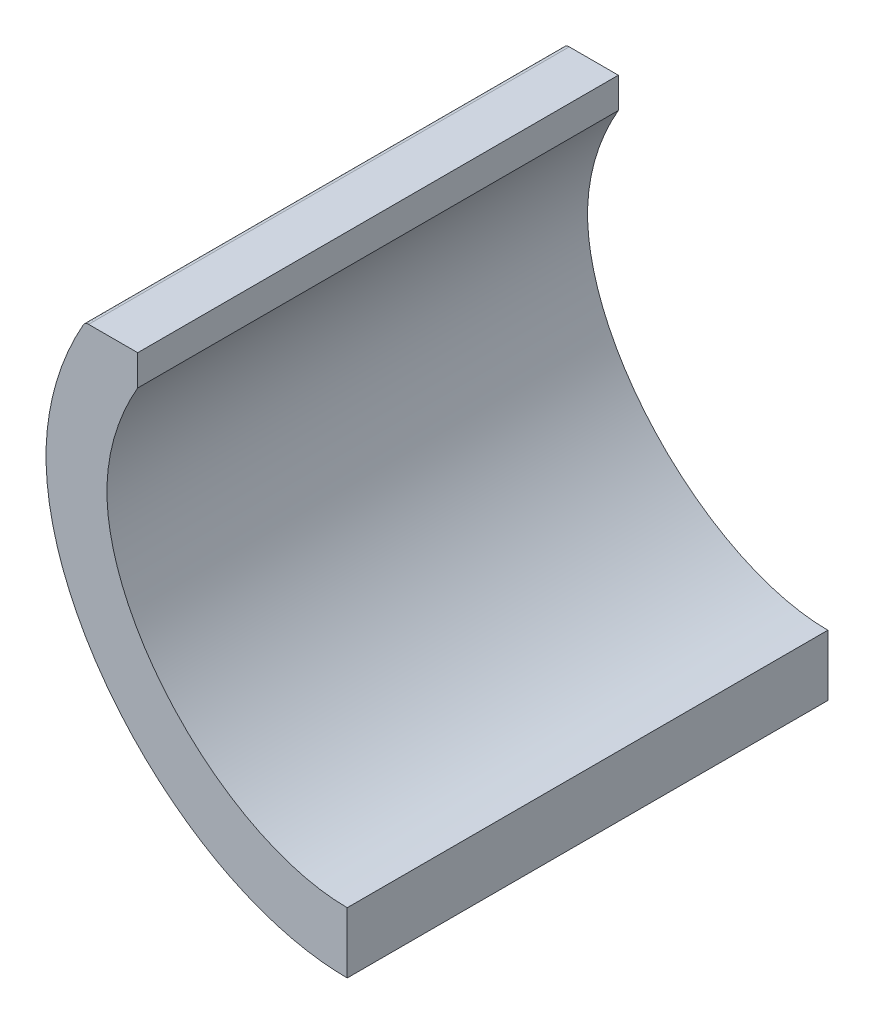
ISO-10303-21;
HEADER;
FILE_DESCRIPTION(('STEP AP214'),'2;1');
FILE_NAME('part.step','',(''),(''),'','','');
FILE_SCHEMA(('AUTOMOTIVE_DESIGN { 1 0 10303 214 1 1 1 1 }'));
ENDSEC;
DATA;
#1=APPLICATION_CONTEXT('core data for automotive mechanical design processes');
#2=APPLICATION_PROTOCOL_DEFINITION('international standard','automotive_design',2000,#1);
#3=PRODUCT_CONTEXT('',#1,'mechanical');
#4=PRODUCT('Part','Part','',(#3));
#5=PRODUCT_RELATED_PRODUCT_CATEGORY('part','',(#4));
#6=PRODUCT_DEFINITION_FORMATION('','',#4);
#7=PRODUCT_DEFINITION_CONTEXT('part definition',#1,'design');
#8=PRODUCT_DEFINITION('design','',#6,#7);
#9=PRODUCT_DEFINITION_SHAPE('','',#8);
#10=(LENGTH_UNIT() NAMED_UNIT(*) SI_UNIT(.MILLI.,.METRE.));
#11=(NAMED_UNIT(*) PLANE_ANGLE_UNIT() SI_UNIT($,.RADIAN.));
#12=(NAMED_UNIT(*) SI_UNIT($,.STERADIAN.) SOLID_ANGLE_UNIT());
#13=UNCERTAINTY_MEASURE_WITH_UNIT(LENGTH_MEASURE(1.E-05),#10,'distance_accuracy_value','');
#14=(GEOMETRIC_REPRESENTATION_CONTEXT(3) GLOBAL_UNCERTAINTY_ASSIGNED_CONTEXT((#13)) GLOBAL_UNIT_ASSIGNED_CONTEXT((#10,
#11,#12)) REPRESENTATION_CONTEXT('',''));
#15=CARTESIAN_POINT('',(0.,0.,0.));
#16=DIRECTION('',(0.,0.,1.));
#17=DIRECTION('',(1.,0.,0.));
#18=AXIS2_PLACEMENT_3D('',#15,#16,#17);
#19=CARTESIAN_POINT('',(-103.230490721796,66.7999999999998,859.861918527202));
#20=DIRECTION('',(6.86583194358813E-12,-1.,0.));
#21=DIRECTION('',(1.,6.86583194358813E-12,0.));
#22=AXIS2_PLACEMENT_3D('',#19,#20,#21);
#23=PLANE('',#22);
#24=DIRECTION('',(-1.,-6.86583194358813E-12,0.));
#25=VECTOR('',#24,1.);
#26=CARTESIAN_POINT('',(-103.230490721796,66.7999999999998,331.59));
#27=LINE('',#26,#25);
#28=CARTESIAN_POINT('',(-103.230490721796,66.7999999999998,331.59));
#29=VERTEX_POINT('',#28);
#30=CARTESIAN_POINT('',(-127.439296538631,66.7999999998336,331.59));
#31=VERTEX_POINT('',#30);
#32=EDGE_CURVE('E125',#29,#31,#27,.T.);
#33=ORIENTED_EDGE('',*,*,#32,.T.);
#34=DIRECTION('',(0.,0.,-1.));
#35=VECTOR('',#34,1.);
#36=CARTESIAN_POINT('',(-127.439296538631,66.7999999998336,859.861918527202));
#37=LINE('',#36,#35);
#38=CARTESIAN_POINT('',(-127.439296538631,66.7999999998336,568.400025));
#39=VERTEX_POINT('',#38);
#40=EDGE_CURVE('E51',#31,#39,#37,.F.);
#41=ORIENTED_EDGE('',*,*,#40,.T.);
#42=DIRECTION('',(1.,6.86583194358813E-12,0.));
#43=VECTOR('',#42,1.);
#44=CARTESIAN_POINT('',(-103.230490721796,66.7999999999998,568.400025));
#45=LINE('',#44,#43);
#46=CARTESIAN_POINT('',(-103.230490721796,66.7999999999998,568.400025));
#47=VERTEX_POINT('',#46);
#48=EDGE_CURVE('E139',#39,#47,#45,.T.);
#49=ORIENTED_EDGE('',*,*,#48,.T.);
#50=DIRECTION('',(0.,0.,-1.));
#51=VECTOR('',#50,1.);
#52=CARTESIAN_POINT('',(-103.230490721796,66.7999999999998,859.861918527202));
#53=LINE('',#52,#51);
#54=EDGE_CURVE('E124',#47,#29,#53,.T.);
#55=ORIENTED_EDGE('',*,*,#54,.T.);
#56=EDGE_LOOP('',(#33,#41,#49,#55));
#57=FACE_BOUND('',#56,.T.);
#58=ADVANCED_FACE('F43',(#57),#23,.F.);
#59=CARTESIAN_POINT('',(-103.230490721796,51.7420302405128,859.861918527202));
#60=DIRECTION('',(-1.,0.,0.));
#61=DIRECTION('',(0.,0.,1.));
#62=AXIS2_PLACEMENT_3D('',#59,#60,#61);
#63=PLANE('',#62);
#64=ORIENTED_EDGE('',*,*,#54,.F.);
#65=DIRECTION('',(0.,-1.,0.));
#66=VECTOR('',#65,1.);
#67=CARTESIAN_POINT('',(-103.230490721796,51.7420302405128,568.400025));
#68=LINE('',#67,#66);
#69=CARTESIAN_POINT('',(-103.230490721796,51.7420302405128,568.400025));
#70=VERTEX_POINT('',#69);
#71=EDGE_CURVE('E133',#47,#70,#68,.T.);
#72=ORIENTED_EDGE('',*,*,#71,.T.);
#73=DIRECTION('',(0.,0.,-1.));
#74=VECTOR('',#73,1.);
#75=CARTESIAN_POINT('',(-103.230490721796,51.7420302405128,859.861918527202));
#76=LINE('',#75,#74);
#77=CARTESIAN_POINT('',(-103.230490721796,51.7420302405128,331.59));
#78=VERTEX_POINT('',#77);
#79=EDGE_CURVE('E106',#70,#78,#76,.T.);
#80=ORIENTED_EDGE('',*,*,#79,.T.);
#81=DIRECTION('',(0.,1.,0.));
#82=VECTOR('',#81,1.);
#83=CARTESIAN_POINT('',(-103.230490721796,51.7420302405128,331.59));
#84=LINE('',#83,#82);
#85=EDGE_CURVE('E113',#78,#29,#84,.T.);
#86=ORIENTED_EDGE('',*,*,#85,.T.);
#87=EDGE_LOOP('',(#64,#72,#80,#86));
#88=FACE_BOUND('',#87,.T.);
#89=ADVANCED_FACE('F177',(#88),#63,.F.);
#90=CARTESIAN_POINT('',(6.41693228043019E-13,-118.400358856441,859.861918527202));
#91=CARTESIAN_POINT('',(-2.30369339179519,-118.400358856441,859.861918527202));
#92=CARTESIAN_POINT('',(-6.89855138055569,-118.205079600366,859.861918527202));
#93=CARTESIAN_POINT('',(-16.1400862810674,-117.063562247159,859.861918527202));
#94=CARTESIAN_POINT('',(-27.7706209094074,-114.278096666344,859.861918527202));
#95=CARTESIAN_POINT('',(-41.7775082353818,-108.787982078801,859.861918527202));
#96=CARTESIAN_POINT('',(-52.8588280845476,-102.77303190265,859.861918527202));
#97=CARTESIAN_POINT('',(-61.3932027242065,-97.1516682907299,859.861918527202));
#98=CARTESIAN_POINT('',(-67.6550724664353,-92.5084789469402,859.861918527202));
#99=CARTESIAN_POINT('',(-73.6989429448788,-87.5008925709732,859.861918527202));
#100=CARTESIAN_POINT('',(-79.4310143248655,-82.2116743731237,859.861918527202));
#101=CARTESIAN_POINT('',(-84.8458794592777,-76.652178793742,859.861918527202));
#102=CARTESIAN_POINT('',(-91.6796199009428,-68.8528896032404,859.861918527202));
#103=CARTESIAN_POINT('',(-97.8613810126001,-60.5401648939101,859.861918527202));
#104=CARTESIAN_POINT('',(-103.300564171315,-51.7703348033556,859.861918527202));
#105=CARTESIAN_POINT('',(-106.913108193542,-45.1017593500004,859.861918527202));
#106=CARTESIAN_POINT('',(-110.090532471186,-38.3001946011175,859.861918527202));
#107=CARTESIAN_POINT('',(-113.679857664725,-29.1493740388695,859.861918527202));
#108=CARTESIAN_POINT('',(-116.331962276113,-19.6740947555543,859.861918527202));
#109=CARTESIAN_POINT('',(-117.843057129504,-10.3834760324185,859.861918527202));
#110=CARTESIAN_POINT('',(-118.417692187507,-3.49664421062236,859.861918527202));
#111=CARTESIAN_POINT('',(-118.429616298773,3.30372576368881,859.861918527202));
#112=CARTESIAN_POINT('',(-117.85285371865,10.3223621182549,859.861918527202));
#113=CARTESIAN_POINT('',(-116.719335417404,17.2909026837772,859.861918527202));
#114=CARTESIAN_POINT('',(-115.041411044254,24.294482858941,859.861918527202));
#115=CARTESIAN_POINT('',(-112.843468002431,31.2634365724681,859.861918527202));
#116=CARTESIAN_POINT('',(-109.206181561247,40.5661828674215,859.861918527202));
#117=CARTESIAN_POINT('',(-105.762926527156,47.3782523280321,859.861918527202));
#118=CARTESIAN_POINT('',(-103.230490721796,51.7420302405128,859.861918527202));
#119=B_SPLINE_CURVE_WITH_KNOTS('',3,(#90,#91,#92,#93,#94,#95,#96,#97,#98,#99,#100,#101,#102,
#103,#104,#105,#106,#107,#108,#109,#110,#111,#112,#113,#114,#115,#116,#117,#118),.UNSPECIFIED.,
.F.,.F.,(4,1,1,1,1,1,1,1,1,1,1,1,1,1,1,1,1,1,1,1,1,1,1,1,1,1,4),(0.118137711005709,
0.14569590753678,0.173254104067852,0.228370497129995,0.283486890192138,0.338603283254282,
0.366161479785353,0.393719676316425,0.421277872847496,0.448836069378568,0.47639426590964,
0.503952462440711,0.559068855502854,0.586627052033926,0.614185248564998,0.641743445096069,
0.669301641627141,0.724418034689284,0.751976231220356,0.779534427751427,0.807092624282499,
0.83465082081357,0.862209017344642,0.889767213875714,0.917325410406785,0.944883606937857,1.),.UNSPECIFIED.);
#120=DIRECTION('',(0.,0.,-1.));
#121=VECTOR('',#120,1.);
#122=SURFACE_OF_LINEAR_EXTRUSION('',#119,#121);
#123=ORIENTED_EDGE('',*,*,#79,.F.);
#124=CARTESIAN_POINT('',(6.41693228043019E-13,-118.400358856441,568.400025));
#125=CARTESIAN_POINT('',(-2.30369339179519,-118.400358856441,568.400025));
#126=CARTESIAN_POINT('',(-6.89855138055569,-118.205079600366,568.400025));
#127=CARTESIAN_POINT('',(-16.1400862810674,-117.063562247159,568.400025));
#128=CARTESIAN_POINT('',(-27.7706209094074,-114.278096666344,568.400025));
#129=CARTESIAN_POINT('',(-41.7775082353818,-108.787982078801,568.400025));
#130=CARTESIAN_POINT('',(-52.8588280845476,-102.77303190265,568.400025));
#131=CARTESIAN_POINT('',(-61.3932027242065,-97.1516682907299,568.400025));
#132=CARTESIAN_POINT('',(-67.6550724664353,-92.5084789469402,568.400025));
#133=CARTESIAN_POINT('',(-73.6989429448788,-87.5008925709732,568.400025));
#134=CARTESIAN_POINT('',(-79.4310143248655,-82.2116743731237,568.400025));
#135=CARTESIAN_POINT('',(-84.8458794592777,-76.652178793742,568.400025));
#136=CARTESIAN_POINT('',(-91.6796199009428,-68.8528896032404,568.400025));
#137=CARTESIAN_POINT('',(-97.8613810126001,-60.5401648939101,568.400025));
#138=CARTESIAN_POINT('',(-103.300564171315,-51.7703348033556,568.400025));
#139=CARTESIAN_POINT('',(-106.913108193542,-45.1017593500004,568.400025));
#140=CARTESIAN_POINT('',(-110.090532471186,-38.3001946011175,568.400025));
#141=CARTESIAN_POINT('',(-113.679857664725,-29.1493740388695,568.400025));
#142=CARTESIAN_POINT('',(-116.331962276113,-19.6740947555543,568.400025));
#143=CARTESIAN_POINT('',(-117.843057129504,-10.3834760324185,568.400025));
#144=CARTESIAN_POINT('',(-118.417692187507,-3.49664421062236,568.400025));
#145=CARTESIAN_POINT('',(-118.429616298773,3.30372576368881,568.400025));
#146=CARTESIAN_POINT('',(-117.85285371865,10.3223621182549,568.400025));
#147=CARTESIAN_POINT('',(-116.719335417404,17.2909026837772,568.400025));
#148=CARTESIAN_POINT('',(-115.041411044254,24.294482858941,568.400025));
#149=CARTESIAN_POINT('',(-112.843468002431,31.2634365724681,568.400025));
#150=CARTESIAN_POINT('',(-109.206181561247,40.5661828674215,568.400025));
#151=CARTESIAN_POINT('',(-105.762926527156,47.3782523280321,568.400025));
#152=CARTESIAN_POINT('',(-103.230490721796,51.7420302405128,568.400025));
#153=B_SPLINE_CURVE_WITH_KNOTS('',3,(#124,#125,#126,#127,#128,#129,#130,#131,#132,#133,#134,
#135,#136,#137,#138,#139,#140,#141,#142,#143,#144,#145,#146,#147,#148,#149,#150,#151,#152),
.UNSPECIFIED.,.F.,.F.,(4,1,1,1,1,1,1,1,1,1,1,1,1,1,1,1,1,1,1,1,1,1,1,1,1,1,4),
(0.118137711005709,0.14569590753678,0.173254104067852,0.228370497129995,0.283486890192138,
0.338603283254282,0.366161479785353,0.393719676316425,0.421277872847496,0.448836069378568,
0.47639426590964,0.503952462440711,0.559068855502854,0.586627052033926,0.614185248564998,
0.641743445096069,0.669301641627141,0.724418034689284,0.751976231220356,0.779534427751427,
0.807092624282499,0.83465082081357,0.862209017344642,0.889767213875714,0.917325410406785,
0.944883606937857,1.),.UNSPECIFIED.);
#154=CARTESIAN_POINT('',(6.41693228043019E-13,-118.400358856441,568.400025));
#155=VERTEX_POINT('',#154);
#156=EDGE_CURVE('E101',#70,#155,#153,.F.);
#157=ORIENTED_EDGE('',*,*,#156,.T.);
#158=DIRECTION('',(0.,0.,-1.));
#159=VECTOR('',#158,1.);
#160=CARTESIAN_POINT('',(6.41693228043019E-13,-118.400358856441,859.861918527202));
#161=LINE('',#160,#159);
#162=CARTESIAN_POINT('',(6.41693228043019E-13,-118.400358856441,331.59));
#163=VERTEX_POINT('',#162);
#164=EDGE_CURVE('E96',#155,#163,#161,.T.);
#165=ORIENTED_EDGE('',*,*,#164,.T.);
#166=CARTESIAN_POINT('',(6.41693228043019E-13,-118.400358856441,331.59));
#167=CARTESIAN_POINT('',(-2.30369339179519,-118.400358856441,331.59));
#168=CARTESIAN_POINT('',(-6.89855138055569,-118.205079600366,331.59));
#169=CARTESIAN_POINT('',(-16.1400862810674,-117.063562247159,331.59));
#170=CARTESIAN_POINT('',(-27.7706209094074,-114.278096666344,331.59));
#171=CARTESIAN_POINT('',(-41.7775082353818,-108.787982078801,331.59));
#172=CARTESIAN_POINT('',(-52.8588280845476,-102.77303190265,331.59));
#173=CARTESIAN_POINT('',(-61.3932027242065,-97.1516682907299,331.59));
#174=CARTESIAN_POINT('',(-67.6550724664353,-92.5084789469402,331.59));
#175=CARTESIAN_POINT('',(-73.6989429448788,-87.5008925709732,331.59));
#176=CARTESIAN_POINT('',(-79.4310143248655,-82.2116743731237,331.59));
#177=CARTESIAN_POINT('',(-84.8458794592777,-76.652178793742,331.59));
#178=CARTESIAN_POINT('',(-91.6796199009428,-68.8528896032404,331.59));
#179=CARTESIAN_POINT('',(-97.8613810126001,-60.5401648939101,331.59));
#180=CARTESIAN_POINT('',(-103.300564171315,-51.7703348033556,331.59));
#181=CARTESIAN_POINT('',(-106.913108193542,-45.1017593500004,331.59));
#182=CARTESIAN_POINT('',(-110.090532471186,-38.3001946011175,331.59));
#183=CARTESIAN_POINT('',(-113.679857664725,-29.1493740388695,331.59));
#184=CARTESIAN_POINT('',(-116.331962276113,-19.6740947555543,331.59));
#185=CARTESIAN_POINT('',(-117.843057129504,-10.3834760324185,331.59));
#186=CARTESIAN_POINT('',(-118.417692187507,-3.49664421062236,331.59));
#187=CARTESIAN_POINT('',(-118.429616298773,3.30372576368881,331.59));
#188=CARTESIAN_POINT('',(-117.85285371865,10.3223621182549,331.59));
#189=CARTESIAN_POINT('',(-116.719335417404,17.2909026837772,331.59));
#190=CARTESIAN_POINT('',(-115.041411044254,24.294482858941,331.59));
#191=CARTESIAN_POINT('',(-112.843468002431,31.2634365724681,331.59));
#192=CARTESIAN_POINT('',(-109.206181561247,40.5661828674215,331.59));
#193=CARTESIAN_POINT('',(-105.762926527156,47.3782523280321,331.59));
#194=CARTESIAN_POINT('',(-103.230490721796,51.7420302405128,331.59));
#195=B_SPLINE_CURVE_WITH_KNOTS('',3,(#166,#167,#168,#169,#170,#171,#172,#173,#174,#175,#176,
#177,#178,#179,#180,#181,#182,#183,#184,#185,#186,#187,#188,#189,#190,#191,#192,#193,#194),
.UNSPECIFIED.,.F.,.F.,(4,1,1,1,1,1,1,1,1,1,1,1,1,1,1,1,1,1,1,1,1,1,1,1,1,1,4),
(0.118137711005709,0.14569590753678,0.173254104067852,0.228370497129995,0.283486890192138,
0.338603283254282,0.366161479785353,0.393719676316425,0.421277872847496,0.448836069378568,
0.47639426590964,0.503952462440711,0.559068855502854,0.586627052033926,0.614185248564998,
0.641743445096069,0.669301641627141,0.724418034689284,0.751976231220356,0.779534427751427,
0.807092624282499,0.83465082081357,0.862209017344642,0.889767213875714,0.917325410406785,
0.944883606937857,1.),.UNSPECIFIED.);
#196=EDGE_CURVE('E100',#163,#78,#195,.T.);
#197=ORIENTED_EDGE('',*,*,#196,.T.);
#198=EDGE_LOOP('',(#123,#157,#165,#197));
#199=FACE_BOUND('',#198,.T.);
#200=ADVANCED_FACE('F99',(#199),#122,.F.);
#201=CARTESIAN_POINT('',(0.,-148.400358856441,859.861918527202));
#202=DIRECTION('',(-1.,0.,0.));
#203=DIRECTION('',(0.,-1.,0.));
#204=AXIS2_PLACEMENT_3D('',#201,#202,#203);
#205=PLANE('',#204);
#206=ORIENTED_EDGE('',*,*,#164,.F.);
#207=DIRECTION('',(0.,-1.,0.));
#208=VECTOR('',#207,1.);
#209=CARTESIAN_POINT('',(0.,-148.400358856441,568.400025));
#210=LINE('',#209,#208);
#211=CARTESIAN_POINT('',(0.,-148.400358856441,568.400025));
#212=VERTEX_POINT('',#211);
#213=EDGE_CURVE('E143',#155,#212,#210,.T.);
#214=ORIENTED_EDGE('',*,*,#213,.T.);
#215=DIRECTION('',(0.,0.,-1.));
#216=VECTOR('',#215,1.);
#217=CARTESIAN_POINT('',(0.,-148.400358856441,859.861918527202));
#218=LINE('',#217,#216);
#219=CARTESIAN_POINT('',(0.,-148.400358856441,331.59));
#220=VERTEX_POINT('',#219);
#221=EDGE_CURVE('E105',#212,#220,#218,.T.);
#222=ORIENTED_EDGE('',*,*,#221,.T.);
#223=DIRECTION('',(0.,1.,0.));
#224=VECTOR('',#223,1.);
#225=CARTESIAN_POINT('',(0.,-148.400358856441,331.59));
#226=LINE('',#225,#224);
#227=EDGE_CURVE('E111',#220,#163,#226,.T.);
#228=ORIENTED_EDGE('',*,*,#227,.T.);
#229=EDGE_LOOP('',(#206,#214,#222,#228));
#230=FACE_BOUND('',#229,.T.);
#231=ADVANCED_FACE('F116',(#230),#205,.F.);
#232=CARTESIAN_POINT('',(-129.177697637527,66.7999999998217,859.861918527202));
#233=CARTESIAN_POINT('',(-129.620986666455,66.0361445570939,859.861918527202));
#234=CARTESIAN_POINT('',(-131.753376367597,62.2914469652341,859.861918527202));
#235=CARTESIAN_POINT('',(-135.362753212301,55.3148651511315,859.861918527202));
#236=CARTESIAN_POINT('',(-139.587846980681,45.5546852918928,859.861918527202));
#237=CARTESIAN_POINT('',(-143.085982257748,35.4803719773955,859.861918527202));
#238=CARTESIAN_POINT('',(-145.768738442522,25.2172081265002,859.861918527202));
#239=CARTESIAN_POINT('',(-147.598187784864,14.7561872219411,859.861918527202));
#240=CARTESIAN_POINT('',(-148.496219867338,4.04425788042876,859.861918527202));
#241=CARTESIAN_POINT('',(-148.371326584092,-6.53933180835297,859.861918527202));
#242=CARTESIAN_POINT('',(-147.273953028146,-17.0502921483484,859.861918527202));
#243=CARTESIAN_POINT('',(-145.252404255944,-27.4973726099557,859.861918527202));
#244=CARTESIAN_POINT('',(-141.377832301458,-41.2721762455534,859.861918527202));
#245=CARTESIAN_POINT('',(-136.008827450591,-54.3142506518048,859.861918527202));
#246=CARTESIAN_POINT('',(-129.322136125918,-66.7861998434544,859.861918527202));
#247=CARTESIAN_POINT('',(-123.638884313971,-75.8797233736565,859.861918527202));
#248=CARTESIAN_POINT('',(-117.410839627805,-84.5647970718849,859.861918527202));
#249=CARTESIAN_POINT('',(-108.463999755934,-95.5393603382679,859.861918527202));
#250=CARTESIAN_POINT('',(-96.1080901826846,-108.196956109459,859.861918527202));
#251=CARTESIAN_POINT('',(-79.3293054574027,-121.67088623105,859.861918527202));
#252=CARTESIAN_POINT('',(-64.299288616478,-130.914132781357,859.861918527202));
#253=CARTESIAN_POINT('',(-51.5796818269899,-137.079745611991,859.861918527202));
#254=CARTESIAN_POINT('',(-41.6243885235952,-141.055777895573,859.861918527202));
#255=CARTESIAN_POINT('',(-31.4400153916219,-144.248668386533,859.861918527202));
#256=CARTESIAN_POINT('',(-21.132268456429,-146.591416072708,859.861918527202));
#257=CARTESIAN_POINT('',(-12.4063892819848,-147.811759093693,859.861918527202));
#258=CARTESIAN_POINT('',(-5.35022941225238,-148.314037414133,859.861918527202));
#259=CARTESIAN_POINT('',(-1.78044168026886,-148.400358856441,859.861918527202));
#260=CARTESIAN_POINT('',(0.,-148.400358856441,859.861918527202));
#261=B_SPLINE_CURVE_WITH_KNOTS('',3,(#232,#233,#234,#235,#236,#237,#238,#239,#240,#241,#242,
#243,#244,#245,#246,#247,#248,#249,#250,#251,#252,#253,#254,#255,#256,#257,#258,#259,#260),
.UNSPECIFIED.,.F.,.F.,(4,1,1,1,1,1,1,1,1,1,1,1,1,1,1,1,1,1,1,1,1,1,1,1,1,1,4),
(0.118137711005709,0.125950211005709,0.15625,0.1875,0.21875,0.25,0.28125,0.3125,0.34375,0.375,
0.40625,0.4375,0.5,0.53125,0.5625,0.59375,0.625,0.6875,0.75,0.8125,0.84375,0.875,0.90625,0.9375,
0.96875,0.984375,1.),.UNSPECIFIED.);
#262=DIRECTION('',(0.,0.,-1.));
#263=VECTOR('',#262,1.);
#264=SURFACE_OF_LINEAR_EXTRUSION('',#261,#263);
#265=CARTESIAN_POINT('',(-129.177697637527,66.7999999998217,568.400025));
#266=CARTESIAN_POINT('',(-129.620986666455,66.0361445570939,568.400025));
#267=CARTESIAN_POINT('',(-131.753376367597,62.2914469652341,568.400025));
#268=CARTESIAN_POINT('',(-135.362753212301,55.3148651511315,568.400025));
#269=CARTESIAN_POINT('',(-139.587846980681,45.5546852918928,568.400025));
#270=CARTESIAN_POINT('',(-143.085982257748,35.4803719773955,568.400025));
#271=CARTESIAN_POINT('',(-145.768738442522,25.2172081265002,568.400025));
#272=CARTESIAN_POINT('',(-147.598187784864,14.7561872219411,568.400025));
#273=CARTESIAN_POINT('',(-148.496219867338,4.04425788042876,568.400025));
#274=CARTESIAN_POINT('',(-148.371326584092,-6.53933180835297,568.400025));
#275=CARTESIAN_POINT('',(-147.273953028146,-17.0502921483484,568.400025));
#276=CARTESIAN_POINT('',(-145.252404255944,-27.4973726099557,568.400025));
#277=CARTESIAN_POINT('',(-141.377832301458,-41.2721762455534,568.400025));
#278=CARTESIAN_POINT('',(-136.008827450591,-54.3142506518048,568.400025));
#279=CARTESIAN_POINT('',(-129.322136125918,-66.7861998434544,568.400025));
#280=CARTESIAN_POINT('',(-123.638884313971,-75.8797233736565,568.400025));
#281=CARTESIAN_POINT('',(-117.410839627805,-84.5647970718849,568.400025));
#282=CARTESIAN_POINT('',(-108.463999755934,-95.5393603382679,568.400025));
#283=CARTESIAN_POINT('',(-96.1080901826846,-108.196956109459,568.400025));
#284=CARTESIAN_POINT('',(-79.3293054574027,-121.67088623105,568.400025));
#285=CARTESIAN_POINT('',(-64.299288616478,-130.914132781357,568.400025));
#286=CARTESIAN_POINT('',(-51.5796818269899,-137.079745611991,568.400025));
#287=CARTESIAN_POINT('',(-41.6243885235952,-141.055777895573,568.400025));
#288=CARTESIAN_POINT('',(-31.4400153916219,-144.248668386533,568.400025));
#289=CARTESIAN_POINT('',(-21.132268456429,-146.591416072708,568.400025));
#290=CARTESIAN_POINT('',(-12.4063892819848,-147.811759093693,568.400025));
#291=CARTESIAN_POINT('',(-5.35022941225238,-148.314037414133,568.400025));
#292=CARTESIAN_POINT('',(-1.78044168026886,-148.400358856441,568.400025));
#293=CARTESIAN_POINT('',(0.,-148.400358856441,568.400025));
#294=B_SPLINE_CURVE_WITH_KNOTS('',3,(#265,#266,#267,#268,#269,#270,#271,#272,#273,#274,#275,
#276,#277,#278,#279,#280,#281,#282,#283,#284,#285,#286,#287,#288,#289,#290,#291,#292,#293),
.UNSPECIFIED.,.F.,.F.,(4,1,1,1,1,1,1,1,1,1,1,1,1,1,1,1,1,1,1,1,1,1,1,1,1,1,4),
(0.118137711005709,0.125950211005709,0.15625,0.1875,0.21875,0.25,0.28125,0.3125,0.34375,0.375,
0.40625,0.4375,0.5,0.53125,0.5625,0.59375,0.625,0.6875,0.75,0.8125,0.84375,0.875,0.90625,0.9375,
0.96875,0.984375,1.),.UNSPECIFIED.);
#295=CARTESIAN_POINT('',(-130.050231629112,65.2775039602973,568.400025));
#296=VERTEX_POINT('',#295);
#297=EDGE_CURVE('E148',#212,#296,#294,.F.);
#298=ORIENTED_EDGE('',*,*,#297,.T.);
#299=DIRECTION('',(0.,0.,-1.));
#300=VECTOR('',#299,1.);
#301=CARTESIAN_POINT('',(-130.050231629112,65.2775039602973,568.400025));
#302=LINE('',#301,#300);
#303=CARTESIAN_POINT('',(-130.050231629112,65.2775039602973,331.59));
#304=VERTEX_POINT('',#303);
#305=EDGE_CURVE('E153',#296,#304,#302,.T.);
#306=ORIENTED_EDGE('',*,*,#305,.T.);
#307=CARTESIAN_POINT('',(-129.177697637527,66.7999999998217,331.59));
#308=CARTESIAN_POINT('',(-129.620986666455,66.0361445570939,331.59));
#309=CARTESIAN_POINT('',(-131.753376367597,62.2914469652341,331.59));
#310=CARTESIAN_POINT('',(-135.362753212301,55.3148651511315,331.59));
#311=CARTESIAN_POINT('',(-139.587846980681,45.5546852918928,331.59));
#312=CARTESIAN_POINT('',(-143.085982257748,35.4803719773955,331.59));
#313=CARTESIAN_POINT('',(-145.768738442522,25.2172081265002,331.59));
#314=CARTESIAN_POINT('',(-147.598187784864,14.7561872219411,331.59));
#315=CARTESIAN_POINT('',(-148.496219867338,4.04425788042876,331.59));
#316=CARTESIAN_POINT('',(-148.371326584092,-6.53933180835297,331.59));
#317=CARTESIAN_POINT('',(-147.273953028146,-17.0502921483484,331.59));
#318=CARTESIAN_POINT('',(-145.252404255944,-27.4973726099557,331.59));
#319=CARTESIAN_POINT('',(-141.377832301458,-41.2721762455534,331.59));
#320=CARTESIAN_POINT('',(-136.008827450591,-54.3142506518048,331.59));
#321=CARTESIAN_POINT('',(-129.322136125918,-66.7861998434544,331.59));
#322=CARTESIAN_POINT('',(-123.638884313971,-75.8797233736565,331.59));
#323=CARTESIAN_POINT('',(-117.410839627805,-84.5647970718849,331.59));
#324=CARTESIAN_POINT('',(-108.463999755934,-95.5393603382679,331.59));
#325=CARTESIAN_POINT('',(-96.1080901826846,-108.196956109459,331.59));
#326=CARTESIAN_POINT('',(-79.3293054574027,-121.67088623105,331.59));
#327=CARTESIAN_POINT('',(-64.299288616478,-130.914132781357,331.59));
#328=CARTESIAN_POINT('',(-51.5796818269899,-137.079745611991,331.59));
#329=CARTESIAN_POINT('',(-41.6243885235952,-141.055777895573,331.59));
#330=CARTESIAN_POINT('',(-31.4400153916219,-144.248668386533,331.59));
#331=CARTESIAN_POINT('',(-21.132268456429,-146.591416072708,331.59));
#332=CARTESIAN_POINT('',(-12.4063892819848,-147.811759093693,331.59));
#333=CARTESIAN_POINT('',(-5.35022941225238,-148.314037414133,331.59));
#334=CARTESIAN_POINT('',(-1.78044168026886,-148.400358856441,331.59));
#335=CARTESIAN_POINT('',(0.,-148.400358856441,331.59));
#336=B_SPLINE_CURVE_WITH_KNOTS('',3,(#307,#308,#309,#310,#311,#312,#313,#314,#315,#316,#317,
#318,#319,#320,#321,#322,#323,#324,#325,#326,#327,#328,#329,#330,#331,#332,#333,#334,#335),
.UNSPECIFIED.,.F.,.F.,(4,1,1,1,1,1,1,1,1,1,1,1,1,1,1,1,1,1,1,1,1,1,1,1,1,1,4),
(0.118137711005709,0.125950211005709,0.15625,0.1875,0.21875,0.25,0.28125,0.3125,0.34375,0.375,
0.40625,0.4375,0.5,0.53125,0.5625,0.59375,0.625,0.6875,0.75,0.8125,0.84375,0.875,0.90625,0.9375,
0.96875,0.984375,1.),.UNSPECIFIED.);
#337=EDGE_CURVE('E120',#304,#220,#336,.T.);
#338=ORIENTED_EDGE('',*,*,#337,.T.);
#339=ORIENTED_EDGE('',*,*,#221,.F.);
#340=EDGE_LOOP('',(#298,#306,#338,#339));
#341=FACE_BOUND('',#340,.T.);
#342=ADVANCED_FACE('F168',(#341),#264,.F.);
#343=CARTESIAN_POINT('',(135.711061394026,-57.9935244642566,568.400025));
#344=DIRECTION('',(0.,0.,-1.));
#345=DIRECTION('',(-1.,0.,0.));
#346=AXIS2_PLACEMENT_3D('',#343,#344,#345);
#347=PLANE('',#346);
#348=ORIENTED_EDGE('',*,*,#48,.F.);
#349=CARTESIAN_POINT('',(-127.439296538611,63.7999999998336,568.400025));
#350=DIRECTION('',(0.,0.,-1.));
#351=DIRECTION('',(-1.,0.,0.));
#352=AXIS2_PLACEMENT_3D('',#349,#350,#351);
#353=CIRCLE('',#352,3.);
#354=EDGE_CURVE('E11',#39,#296,#353,.F.);
#355=ORIENTED_EDGE('',*,*,#354,.T.);
#356=ORIENTED_EDGE('',*,*,#297,.F.);
#357=ORIENTED_EDGE('',*,*,#213,.F.);
#358=ORIENTED_EDGE('',*,*,#156,.F.);
#359=ORIENTED_EDGE('',*,*,#71,.F.);
#360=EDGE_LOOP('',(#348,#355,#356,#357,#358,#359));
#361=FACE_BOUND('',#360,.T.);
#362=ADVANCED_FACE('F171',(#361),#347,.F.);
#363=CARTESIAN_POINT('',(135.711061394026,-57.9935244642566,331.59));
#364=DIRECTION('',(0.,0.,-1.));
#365=DIRECTION('',(-1.,0.,0.));
#366=AXIS2_PLACEMENT_3D('',#363,#364,#365);
#367=PLANE('',#366);
#368=ORIENTED_EDGE('',*,*,#337,.F.);
#369=CARTESIAN_POINT('',(-127.439296538611,63.7999999998336,331.59));
#370=DIRECTION('',(0.,0.,-1.));
#371=DIRECTION('',(-1.,0.,0.));
#372=AXIS2_PLACEMENT_3D('',#369,#370,#371);
#373=CIRCLE('',#372,3.);
#374=EDGE_CURVE('E65',#304,#31,#373,.T.);
#375=ORIENTED_EDGE('',*,*,#374,.T.);
#376=ORIENTED_EDGE('',*,*,#32,.F.);
#377=ORIENTED_EDGE('',*,*,#85,.F.);
#378=ORIENTED_EDGE('',*,*,#196,.F.);
#379=ORIENTED_EDGE('',*,*,#227,.F.);
#380=EDGE_LOOP('',(#368,#375,#376,#377,#378,#379));
#381=FACE_BOUND('',#380,.T.);
#382=ADVANCED_FACE('F110',(#381),#367,.T.);
#383=CARTESIAN_POINT('',(-127.439296538611,63.7999999998336,449.9950125));
#384=DIRECTION('',(0.,0.,-1.));
#385=DIRECTION('',(-1.,0.,0.));
#386=AXIS2_PLACEMENT_3D('',#383,#384,#385);
#387=CYLINDRICAL_SURFACE('',#386,3.);
#388=ORIENTED_EDGE('',*,*,#354,.F.);
#389=ORIENTED_EDGE('',*,*,#40,.F.);
#390=ORIENTED_EDGE('',*,*,#374,.F.);
#391=ORIENTED_EDGE('',*,*,#305,.F.);
#392=EDGE_LOOP('',(#388,#389,#390,#391));
#393=FACE_BOUND('',#392,.T.);
#394=ADVANCED_FACE('F45',(#393),#387,.T.);
#395=CLOSED_SHELL('',(#58,#89,#200,#231,#342,#362,#382,#394));
#396=MANIFOLD_SOLID_BREP('B2',#395);
#397=ADVANCED_BREP_SHAPE_REPRESENTATION('',(#18,#396),#14);
#398=SHAPE_DEFINITION_REPRESENTATION(#9,#397);
ENDSEC;
END-ISO-10303-21;
